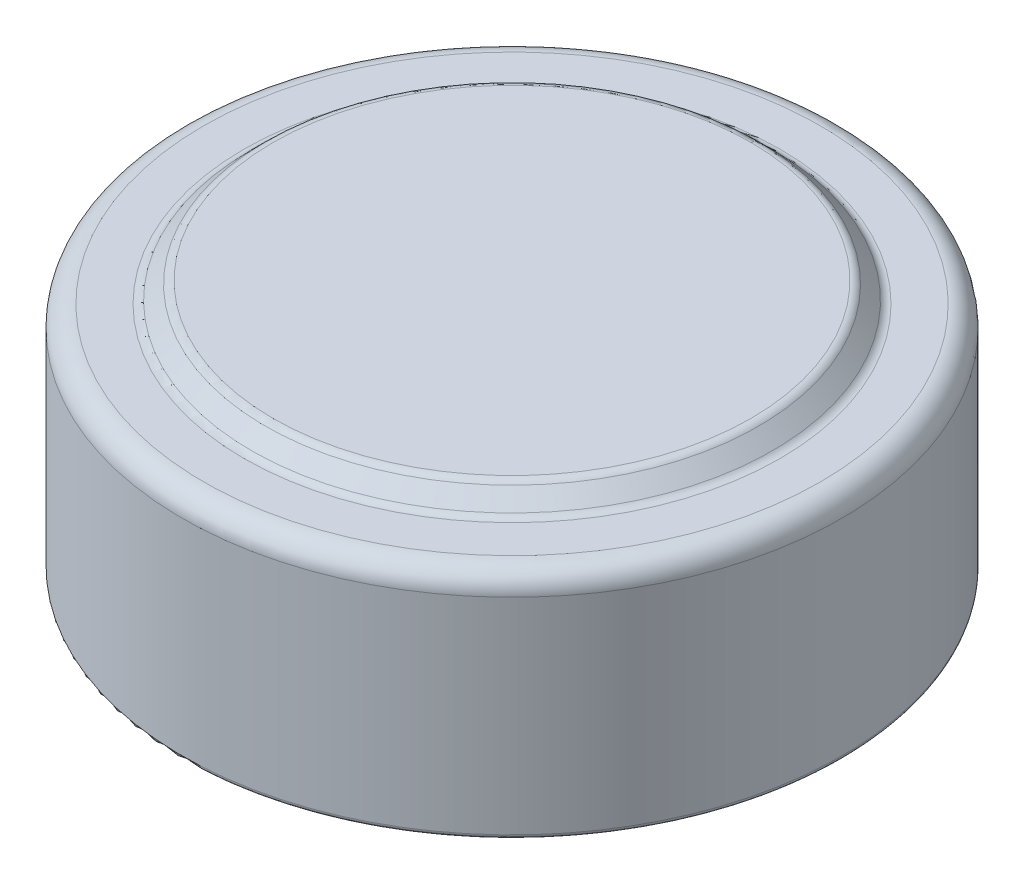
ISO-10303-21;
HEADER;
FILE_DESCRIPTION(('STEP AP214'),'2;1');
FILE_NAME('part.step','',(''),(''),'','','');
FILE_SCHEMA(('AUTOMOTIVE_DESIGN { 1 0 10303 214 1 1 1 1 }'));
ENDSEC;
DATA;
#1=APPLICATION_CONTEXT('core data for automotive mechanical design processes');
#2=APPLICATION_PROTOCOL_DEFINITION('international standard','automotive_design',2000,#1);
#3=PRODUCT_CONTEXT('',#1,'mechanical');
#4=PRODUCT('Part','Part','',(#3));
#5=PRODUCT_RELATED_PRODUCT_CATEGORY('part','',(#4));
#6=PRODUCT_DEFINITION_FORMATION('','',#4);
#7=PRODUCT_DEFINITION_CONTEXT('part definition',#1,'design');
#8=PRODUCT_DEFINITION('design','',#6,#7);
#9=PRODUCT_DEFINITION_SHAPE('','',#8);
#10=(LENGTH_UNIT() NAMED_UNIT(*) SI_UNIT(.MILLI.,.METRE.));
#11=(NAMED_UNIT(*) PLANE_ANGLE_UNIT() SI_UNIT($,.RADIAN.));
#12=(NAMED_UNIT(*) SI_UNIT($,.STERADIAN.) SOLID_ANGLE_UNIT());
#13=UNCERTAINTY_MEASURE_WITH_UNIT(LENGTH_MEASURE(1.E-05),#10,'distance_accuracy_value','');
#14=(GEOMETRIC_REPRESENTATION_CONTEXT(3) GLOBAL_UNCERTAINTY_ASSIGNED_CONTEXT((#13)) GLOBAL_UNIT_ASSIGNED_CONTEXT((#10,
#11,#12)) REPRESENTATION_CONTEXT('',''));
#15=CARTESIAN_POINT('',(0.,0.,0.));
#16=DIRECTION('',(0.,0.,1.));
#17=DIRECTION('',(1.,0.,0.));
#18=AXIS2_PLACEMENT_3D('',#15,#16,#17);
#19=CARTESIAN_POINT('',(0.,0.,0.));
#20=DIRECTION('',(0.,-1.,0.));
#21=DIRECTION('',(1.,0.,0.));
#22=AXIS2_PLACEMENT_3D('',#19,#20,#21);
#23=PLANE('',#22);
#24=DIRECTION('',(-1.,0.,0.));
#25=VECTOR('',#24,1.);
#26=CARTESIAN_POINT('',(-0.25,0.,2.));
#27=LINE('',#26,#25);
#28=CARTESIAN_POINT('',(0.25,0.,2.));
#29=VERTEX_POINT('',#28);
#30=CARTESIAN_POINT('',(-0.25,0.,2.));
#31=VERTEX_POINT('',#30);
#32=EDGE_CURVE('E1349',#29,#31,#27,.T.);
#33=ORIENTED_EDGE('',*,*,#32,.T.);
#34=DIRECTION('',(0.,0.,-1.));
#35=VECTOR('',#34,1.);
#36=CARTESIAN_POINT('',(-0.25,0.,2.));
#37=LINE('',#36,#35);
#38=CARTESIAN_POINT('',(-0.25,0.,0.25));
#39=VERTEX_POINT('',#38);
#40=EDGE_CURVE('E13',#31,#39,#37,.T.);
#41=ORIENTED_EDGE('',*,*,#40,.T.);
#42=DIRECTION('',(-1.,0.,0.));
#43=VECTOR('',#42,1.);
#44=CARTESIAN_POINT('',(-2.,0.,0.25));
#45=LINE('',#44,#43);
#46=CARTESIAN_POINT('',(-2.,0.,0.25));
#47=VERTEX_POINT('',#46);
#48=EDGE_CURVE('E1017',#39,#47,#45,.T.);
#49=ORIENTED_EDGE('',*,*,#48,.T.);
#50=DIRECTION('',(0.,0.,-1.));
#51=VECTOR('',#50,1.);
#52=CARTESIAN_POINT('',(-2.,0.,0.25));
#53=LINE('',#52,#51);
#54=CARTESIAN_POINT('',(-2.,0.,-0.25));
#55=VERTEX_POINT('',#54);
#56=EDGE_CURVE('E1376',#47,#55,#53,.T.);
#57=ORIENTED_EDGE('',*,*,#56,.T.);
#58=DIRECTION('',(1.,0.,0.));
#59=VECTOR('',#58,1.);
#60=CARTESIAN_POINT('',(-2.,0.,-0.25));
#61=LINE('',#60,#59);
#62=CARTESIAN_POINT('',(-0.25,0.,-0.25));
#63=VERTEX_POINT('',#62);
#64=EDGE_CURVE('E1373',#55,#63,#61,.T.);
#65=ORIENTED_EDGE('',*,*,#64,.T.);
#66=DIRECTION('',(0.,0.,-1.));
#67=VECTOR('',#66,1.);
#68=CARTESIAN_POINT('',(-0.25,0.,-0.25));
#69=LINE('',#68,#67);
#70=CARTESIAN_POINT('',(-0.25,0.,-2.));
#71=VERTEX_POINT('',#70);
#72=EDGE_CURVE('E1370',#63,#71,#69,.T.);
#73=ORIENTED_EDGE('',*,*,#72,.T.);
#74=DIRECTION('',(1.,0.,0.));
#75=VECTOR('',#74,1.);
#76=CARTESIAN_POINT('',(-0.25,0.,-2.));
#77=LINE('',#76,#75);
#78=CARTESIAN_POINT('',(0.25,0.,-2.));
#79=VERTEX_POINT('',#78);
#80=EDGE_CURVE('E1367',#71,#79,#77,.T.);
#81=ORIENTED_EDGE('',*,*,#80,.T.);
#82=DIRECTION('',(0.,0.,1.));
#83=VECTOR('',#82,1.);
#84=CARTESIAN_POINT('',(0.25,0.,-0.25));
#85=LINE('',#84,#83);
#86=CARTESIAN_POINT('',(0.25,0.,-0.25));
#87=VERTEX_POINT('',#86);
#88=EDGE_CURVE('E1364',#79,#87,#85,.T.);
#89=ORIENTED_EDGE('',*,*,#88,.T.);
#90=DIRECTION('',(1.,0.,0.));
#91=VECTOR('',#90,1.);
#92=CARTESIAN_POINT('',(0.25,0.,-0.25));
#93=LINE('',#92,#91);
#94=CARTESIAN_POINT('',(2.,0.,-0.25));
#95=VERTEX_POINT('',#94);
#96=EDGE_CURVE('E1361',#87,#95,#93,.T.);
#97=ORIENTED_EDGE('',*,*,#96,.T.);
#98=DIRECTION('',(0.,0.,1.));
#99=VECTOR('',#98,1.);
#100=CARTESIAN_POINT('',(2.,0.,0.25));
#101=LINE('',#100,#99);
#102=CARTESIAN_POINT('',(2.,0.,0.25));
#103=VERTEX_POINT('',#102);
#104=EDGE_CURVE('E1358',#95,#103,#101,.T.);
#105=ORIENTED_EDGE('',*,*,#104,.T.);
#106=DIRECTION('',(-1.,0.,0.));
#107=VECTOR('',#106,1.);
#108=CARTESIAN_POINT('',(0.25,0.,0.25));
#109=LINE('',#108,#107);
#110=CARTESIAN_POINT('',(0.25,0.,0.25));
#111=VERTEX_POINT('',#110);
#112=EDGE_CURVE('E1355',#103,#111,#109,.T.);
#113=ORIENTED_EDGE('',*,*,#112,.T.);
#114=DIRECTION('',(0.,0.,1.));
#115=VECTOR('',#114,1.);
#116=CARTESIAN_POINT('',(0.25,0.,2.));
#117=LINE('',#116,#115);
#118=EDGE_CURVE('E1352',#111,#29,#117,.T.);
#119=ORIENTED_EDGE('',*,*,#118,.T.);
#120=EDGE_LOOP('',(#33,#41,#49,#57,#65,#73,#81,#89,#97,#105,#113,#119));
#121=FACE_BOUND('',#120,.T.);
#122=ADVANCED_FACE('F1008',(#121),#23,.T.);
#123=ORIENTED_EDGE('',*,*,#40,.F.);
#124=ORIENTED_EDGE('',*,*,#32,.F.);
#125=ORIENTED_EDGE('',*,*,#118,.F.);
#126=ORIENTED_EDGE('',*,*,#112,.F.);
#127=ORIENTED_EDGE('',*,*,#104,.F.);
#128=ORIENTED_EDGE('',*,*,#96,.F.);
#129=ORIENTED_EDGE('',*,*,#88,.F.);
#130=ORIENTED_EDGE('',*,*,#80,.F.);
#131=ORIENTED_EDGE('',*,*,#72,.F.);
#132=ORIENTED_EDGE('',*,*,#64,.F.);
#133=ORIENTED_EDGE('',*,*,#56,.F.);
#134=ORIENTED_EDGE('',*,*,#48,.F.);
#135=EDGE_LOOP('',(#123,#124,#125,#126,#127,#128,#129,#130,#131,#132,#133,#134));
#136=FACE_BOUND('',#135,.T.);
#137=DIRECTION('',(-0.999997967618059,0.,-0.00201612493470823));
#138=VECTOR('',#137,1.);
#139=CARTESIAN_POINT('',(-0.24575017276862,0.,5.48015218725689));
#140=LINE('',#139,#138);
#141=CARTESIAN_POINT('',(-0.24575017276862,0.,5.48015218725689));
#142=VERTEX_POINT('',#141);
#143=CARTESIAN_POINT('',(-0.345109147127594,0.,5.47995186674407));
#144=VERTEX_POINT('',#143);
#145=EDGE_CURVE('E1252',#142,#144,#140,.T.);
#146=ORIENTED_EDGE('',*,*,#145,.T.);
#147=DIRECTION('',(-0.00181268584365623,0.,0.999998357083667));
#148=VECTOR('',#147,1.);
#149=CARTESIAN_POINT('',(-0.345109147127594,0.,5.47995186674407));
#150=LINE('',#149,#148);
#151=CARTESIAN_POINT('',(-0.346912031742979,0.,6.47454321289792));
#152=VERTEX_POINT('',#151);
#153=EDGE_CURVE('E1301',#144,#152,#150,.T.);
#154=ORIENTED_EDGE('',*,*,#153,.T.);
#155=DIRECTION('',(0.999997955269475,0.,0.002022240556661));
#156=VECTOR('',#155,1.);
#157=CARTESIAN_POINT('',(-0.346912031742979,0.,6.47454321289792));
#158=LINE('',#157,#156);
#159=CARTESIAN_POINT('',(-0.148795044563491,0.,6.47494385392356));
#160=VERTEX_POINT('',#159);
#161=EDGE_CURVE('E1295',#152,#160,#158,.T.);
#162=ORIENTED_EDGE('',*,*,#161,.T.);
#163=CARTESIAN_POINT('',(-0.148795044563491,0.,6.47494385392356));
#164=CARTESIAN_POINT('',(-0.135573615375887,0.,6.47490884577443));
#165=CARTESIAN_POINT('',(-0.110197659418802,0.,6.47484165445662));
#166=CARTESIAN_POINT('',(-0.0738032934458553,0.,6.47424174496659));
#167=CARTESIAN_POINT('',(-0.0406778357751591,0.,6.47327697200537));
#168=CARTESIAN_POINT('',(-0.0108947807294857,0.,6.47186780170862));
#169=CARTESIAN_POINT('',(0.0155790556774669,0.,6.47023352238498));
#170=CARTESIAN_POINT('',(0.0385933181856352,0.,6.46768137392707));
#171=CARTESIAN_POINT('',(0.0583744991553882,0.,6.46536378822217));
#172=CARTESIAN_POINT('',(0.0703014037181199,0.,6.46286651782277));
#173=CARTESIAN_POINT('',(0.0757642503083034,0.,6.4617227000774));
#174=B_SPLINE_CURVE_WITH_KNOTS('',3,(#163,#164,#165,#166,#167,#168,#169,#170,#171,#172,#173),
.UNSPECIFIED.,.F.,.F.,(4,1,1,1,1,1,1,1,4),(0.,0.176064366226752,0.337921229209516,
0.484707011570861,0.617344334054567,0.73499158843748,0.837805101821769,0.92571032644742,1.),.UNSPECIFIED.);
#175=CARTESIAN_POINT('',(0.0757642503083034,0.,6.4617227000774));
#176=VERTEX_POINT('',#175);
#177=EDGE_CURVE('E1287',#160,#176,#174,.T.);
#178=ORIENTED_EDGE('',*,*,#177,.T.);
#179=CARTESIAN_POINT('',(0.0757642503083034,0.,6.4617227000774));
#180=CARTESIAN_POINT('',(0.0830080483921917,0.,6.45989783311528));
#181=CARTESIAN_POINT('',(0.0973197268117107,0.,6.45629241661721));
#182=CARTESIAN_POINT('',(0.118003053982155,0.,6.44900128398854));
#183=CARTESIAN_POINT('',(0.137691030550522,0.,6.4403715934872));
#184=CARTESIAN_POINT('',(0.156422090818116,0.,6.43042051802343));
#185=CARTESIAN_POINT('',(0.173886966404073,0.,6.41866791868947));
#186=CARTESIAN_POINT('',(0.19036867983076,0.,6.40561350071653));
#187=CARTESIAN_POINT('',(0.205910914579534,0.,6.39113201257329));
#188=CARTESIAN_POINT('',(0.220152758802699,0.,6.37517293789059));
#189=CARTESIAN_POINT('',(0.233353258995435,0.,6.35820196970024));
#190=CARTESIAN_POINT('',(0.244448510218859,0.,6.33987520974977));
#191=CARTESIAN_POINT('',(0.254155301622547,0.,6.32084163012419));
#192=CARTESIAN_POINT('',(0.26207532802548,0.,6.3008051988161));
#193=CARTESIAN_POINT('',(0.267983890857681,0.,6.27970079109947));
#194=CARTESIAN_POINT('',(0.272426994834388,0.,6.25768056785205));
#195=CARTESIAN_POINT('',(0.275036823775737,0.,6.23468777408315));
#196=CARTESIAN_POINT('',(0.275465686854256,0.,6.2190742584543));
#197=CARTESIAN_POINT('',(0.275684122103175,0.,6.21112173853894));
#198=B_SPLINE_CURVE_WITH_KNOTS('',3,(#179,#180,#181,#182,#183,#184,#185,#186,#187,#188,#189,
#190,#191,#192,#193,#194,#195,#196,#197),.UNSPECIFIED.,.F.,.F.,(4,1,1,1,1,1,1,1,1,1,1,1,1,1,1,1,
4),(0.,0.0643523488828735,0.127141882212433,0.188727908886166,0.249491091520758,
0.309662784300045,0.369878490392546,0.430543491877956,0.492480729177977,0.554058689398358,
0.61554784879087,0.676799576580252,0.738032378235542,0.800874631585583,0.865429932550656,
0.931458669088941,1.),.UNSPECIFIED.);
#199=CARTESIAN_POINT('',(0.275684122103175,0.,6.21112173853894));
#200=VERTEX_POINT('',#199);
#201=EDGE_CURVE('E1279',#176,#200,#198,.T.);
#202=ORIENTED_EDGE('',*,*,#201,.T.);
#203=CARTESIAN_POINT('',(0.275684122103175,0.,6.21112173853894));
#204=CARTESIAN_POINT('',(0.275222894472053,0.,6.19800412707376));
#205=CARTESIAN_POINT('',(0.274321737643172,0.,6.17237464533238));
#206=CARTESIAN_POINT('',(0.2672492599839,0.,6.13508305551279));
#207=CARTESIAN_POINT('',(0.255075022756078,0.,6.10033178458293));
#208=CARTESIAN_POINT('',(0.238480463193786,0.,6.06812832839628));
#209=CARTESIAN_POINT('',(0.217301192842413,0.,6.0390402962661));
#210=CARTESIAN_POINT('',(0.191806234558142,0.,6.01358021747295));
#211=CARTESIAN_POINT('',(0.162148142323468,0.,5.99191729657077));
#212=CARTESIAN_POINT('',(0.134248514928151,0.,5.97731261963704));
#213=CARTESIAN_POINT('',(0.109736289266416,0.,5.96756363612358));
#214=CARTESIAN_POINT('',(0.0894420691499433,0.,5.96117180276661));
#215=CARTESIAN_POINT('',(0.0674699067692535,0.,5.95584422892102));
#216=CARTESIAN_POINT('',(0.0438400090574644,0.,5.95112991776116));
#217=CARTESIAN_POINT('',(0.0183879704000981,0.,5.94791198763913));
#218=CARTESIAN_POINT('',(-0.00866689077815023,0.,5.94532558628991));
#219=CARTESIAN_POINT('',(-0.0373897687380123,0.,5.94338771855144));
#220=CARTESIAN_POINT('',(-0.0571116107730482,0.,5.94319308930524));
#221=CARTESIAN_POINT('',(-0.0672645958455428,0.,5.9430928923851));
#222=B_SPLINE_CURVE_WITH_KNOTS('',3,(#203,#204,#205,#206,#207,#208,#209,#210,#211,#212,#213,
#214,#215,#216,#217,#218,#219,#220,#221),.UNSPECIFIED.,.F.,.F.,(4,1,1,1,1,1,1,1,1,1,1,1,1,1,1,1,
4),(0.,0.0795044829155837,0.155337631294389,0.229091952793264,0.302069838470641,
0.37422546277292,0.446370863111379,0.519658073481947,0.596085510995983,0.636609633392865,
0.67950558232071,0.724970943763673,0.77364551180172,0.825523512467502,0.880434745486717,
0.938446710905309,1.),.UNSPECIFIED.);
#223=CARTESIAN_POINT('',(-0.0672645958455432,0.,5.9430928923851));
#224=VERTEX_POINT('',#223);
#225=EDGE_CURVE('E1274',#200,#224,#222,.T.);
#226=ORIENTED_EDGE('',*,*,#225,.T.);
#227=DIRECTION('',(0.612967601433019,0.,-0.790108042987446));
#228=VECTOR('',#227,1.);
#229=CARTESIAN_POINT('',(-0.0672645958455428,0.,5.9430928923851));
#230=LINE('',#229,#228);
#231=CARTESIAN_POINT('',(0.291108801590355,0.,5.48115378982099));
#232=VERTEX_POINT('',#231);
#233=EDGE_CURVE('E1271',#224,#232,#230,.T.);
#234=ORIENTED_EDGE('',*,*,#233,.T.);
#235=DIRECTION('',(-0.99999867372862,0.,-0.00162866233505838));
#236=VECTOR('',#235,1.);
#237=CARTESIAN_POINT('',(0.291108801590355,0.,5.48115378982099));
#238=LINE('',#237,#236);
#239=CARTESIAN_POINT('',(0.16811200671856,0.,5.48095346930817));
#240=VERTEX_POINT('',#239);
#241=EDGE_CURVE('E1268',#232,#240,#238,.T.);
#242=ORIENTED_EDGE('',*,*,#241,.T.);
#243=DIRECTION('',(-0.612491317030842,0.,0.790477315652906));
#244=VECTOR('',#243,1.);
#245=CARTESIAN_POINT('',(0.16811200671856,0.,5.48095346930817));
#246=LINE('',#245,#244);
#247=CARTESIAN_POINT('',(-0.189660429178876,0.,5.94269225135946));
#248=VERTEX_POINT('',#247);
#249=EDGE_CURVE('E1265',#240,#248,#246,.T.);
#250=ORIENTED_EDGE('',*,*,#249,.T.);
#251=DIRECTION('',(-1.,0.,0.));
#252=VECTOR('',#251,1.);
#253=CARTESIAN_POINT('',(-0.189660429178876,0.,5.94269225135946));
#254=LINE('',#253,#252);
#255=CARTESIAN_POINT('',(-0.246551454819902,0.,5.94269225135946));
#256=VERTEX_POINT('',#255);
#257=EDGE_CURVE('E1262',#248,#256,#254,.T.);
#258=ORIENTED_EDGE('',*,*,#257,.T.);
#259=DIRECTION('',(0.0017323490679639,0.,-0.999998499482228));
#260=VECTOR('',#259,1.);
#261=CARTESIAN_POINT('',(-0.246551454819902,0.,5.94269225135946));
#262=LINE('',#261,#260);
#263=EDGE_CURVE('E1259',#256,#142,#262,.T.);
#264=ORIENTED_EDGE('',*,*,#263,.T.);
#265=EDGE_LOOP('',(#146,#154,#162,#178,#202,#226,#234,#242,#250,#258,#264));
#266=FACE_BOUND('',#265,.T.);
#267=CARTESIAN_POINT('',(0.,0.,0.));
#268=DIRECTION('',(0.,1.,0.));
#269=DIRECTION('',(-1.,0.,0.));
#270=AXIS2_PLACEMENT_3D('',#267,#268,#269);
#271=CIRCLE('',#270,7.7);
#272=CARTESIAN_POINT('',(-7.7,0.,0.));
#273=VERTEX_POINT('',#272);
#274=EDGE_CURVE('E1172',#273,#273,#271,.T.);
#275=ORIENTED_EDGE('',*,*,#274,.F.);
#276=EDGE_LOOP('',(#275));
#277=FACE_BOUND('',#276,.T.);
#278=CARTESIAN_POINT('',(1.14440576339474,0.,6.10257797058904));
#279=CARTESIAN_POINT('',(1.14267778538298,0.,6.0923150395133));
#280=CARTESIAN_POINT('',(1.13915884606007,0.,6.07141510242788));
#281=CARTESIAN_POINT('',(1.12982491620683,0.,6.04038488079859));
#282=CARTESIAN_POINT('',(1.11787759470241,0.,6.00893149353778));
#283=CARTESIAN_POINT('',(1.10493701739911,0.,5.98296985677421));
#284=CARTESIAN_POINT('',(1.09301371672932,0.,5.9616758514408));
#285=CARTESIAN_POINT('',(1.08254375562409,0.,5.94486223929022));
#286=CARTESIAN_POINT('',(1.07080292715997,0.,5.92734512816029));
#287=CARTESIAN_POINT('',(1.05766314999315,0.,5.90920521122916));
#288=CARTESIAN_POINT('',(1.04320383365771,0.,5.89044697297638));
#289=CARTESIAN_POINT('',(1.02763621728649,0.,5.87077553434667));
#290=CARTESIAN_POINT('',(1.01059151988626,0.,5.85054321434036));
#291=CARTESIAN_POINT('',(0.998540350521887,0.,5.83705606415367));
#292=CARTESIAN_POINT('',(0.992362494163972,0.,5.83014207315314));
#293=B_SPLINE_CURVE_WITH_KNOTS('',3,(#278,#279,#280,#281,#282,#283,#284,#285,#286,#287,#288,
#289,#290,#291,#292),.UNSPECIFIED.,.F.,.F.,(4,1,1,1,1,1,1,1,1,1,1,1,4),(0.,0.0984850773633282,
0.200559850354269,0.306265127676059,0.416855952475023,0.474905590193942,0.537385366755915,
0.604390447329588,0.674601910387479,0.749485829544024,0.828699173871165,0.912185127781514,1.),.UNSPECIFIED.);
#294=CARTESIAN_POINT('',(1.14440576339474,0.,6.10257797058904));
#295=VERTEX_POINT('',#294);
#296=CARTESIAN_POINT('',(0.992362494163972,0.,5.83014207315314));
#297=VERTEX_POINT('',#296);
#298=EDGE_CURVE('E1163',#295,#297,#293,.T.);
#299=ORIENTED_EDGE('',*,*,#298,.T.);
#300=DIRECTION('',(-0.665625985954595,0.,-0.746285499538865));
#301=VECTOR('',#300,1.);
#302=CARTESIAN_POINT('',(0.992362494163972,0.,5.83014207315314));
#303=LINE('',#302,#301);
#304=CARTESIAN_POINT('',(0.63198589159987,0.,5.42609559879417));
#305=VERTEX_POINT('',#304);
#306=EDGE_CURVE('E1170',#297,#305,#303,.T.);
#307=ORIENTED_EDGE('',*,*,#306,.T.);
#308=DIRECTION('',(-0.757655677533589,0.,0.652654483092792));
#309=VECTOR('',#308,1.);
#310=CARTESIAN_POINT('',(0.63198589159987,0.,5.42609559879417));
#311=LINE('',#310,#309);
#312=CARTESIAN_POINT('',(0.558267942881921,0.,5.48959720135827));
#313=VERTEX_POINT('',#312);
#314=EDGE_CURVE('E1217',#305,#313,#311,.T.);
#315=ORIENTED_EDGE('',*,*,#314,.T.);
#316=DIRECTION('',(0.659812489585063,0.,0.75143028857477));
#317=VECTOR('',#316,1.);
#318=CARTESIAN_POINT('',(0.558267942881921,0.,5.48959720135827));
#319=LINE('',#318,#317);
#320=CARTESIAN_POINT('',(0.879982686471665,0.,5.85598341930699));
#321=VERTEX_POINT('',#320);
#322=EDGE_CURVE('E1211',#313,#321,#319,.T.);
#323=ORIENTED_EDGE('',*,*,#322,.T.);
#324=CARTESIAN_POINT('',(0.879982686471665,0.,5.85598341930699));
#325=CARTESIAN_POINT('',(0.87085302576854,0.,5.85448633834904));
#326=CARTESIAN_POINT('',(0.853064744087003,0.,5.85156941748572));
#327=CARTESIAN_POINT('',(0.826661988511281,0.,5.84999031332602));
#328=CARTESIAN_POINT('',(0.801394499816977,0.,5.849638626471));
#329=CARTESIAN_POINT('',(0.785021760742135,0.,5.85147831691324));
#330=CARTESIAN_POINT('',(0.777017942881921,0.,5.85237765007622));
#331=B_SPLINE_CURVE_WITH_KNOTS('',3,(#324,#325,#326,#327,#328,#329,#330),.UNSPECIFIED.,.F.,.F.,
(4,1,1,1,4),(0.,0.268180892066763,0.522525141384143,0.766586288114427,1.),.UNSPECIFIED.);
#332=CARTESIAN_POINT('',(0.777017942881921,0.,5.85237765007622));
#333=VERTEX_POINT('',#332);
#334=EDGE_CURVE('E1203',#321,#333,#331,.T.);
#335=ORIENTED_EDGE('',*,*,#334,.T.);
#336=CARTESIAN_POINT('',(0.777017942881921,0.,5.85237765007622));
#337=CARTESIAN_POINT('',(0.767426123873589,0.,5.85390903408389));
#338=CARTESIAN_POINT('',(0.748560836755377,0.,5.85692097571539));
#339=CARTESIAN_POINT('',(0.721321672266046,0.,5.86491272273913));
#340=CARTESIAN_POINT('',(0.695612433643268,0.,5.87531080995275));
#341=CARTESIAN_POINT('',(0.671405570163664,0.,5.8882533614665));
#342=CARTESIAN_POINT('',(0.648592773788989,0.,5.90354798167863));
#343=CARTESIAN_POINT('',(0.627340647198401,0.,5.92144823799871));
#344=CARTESIAN_POINT('',(0.607572859626174,0.,5.94187377795498));
#345=CARTESIAN_POINT('',(0.589559940034781,0.,5.9644987566015));
#346=CARTESIAN_POINT('',(0.573562921755995,0.,5.98882515997987));
#347=CARTESIAN_POINT('',(0.560150358543541,0.,6.01434248615343));
#348=CARTESIAN_POINT('',(0.549144264585504,0.,6.04061754257484));
#349=CARTESIAN_POINT('',(0.541411298963939,0.,6.06788558241053));
#350=CARTESIAN_POINT('',(0.536147369101856,0.,6.09591372886544));
#351=CARTESIAN_POINT('',(0.533564243197429,0.,6.12481830573977));
#352=CARTESIAN_POINT('',(0.533684940710717,0.,6.15468442474335));
#353=CARTESIAN_POINT('',(0.536036288445922,0.,6.17470785699227));
#354=CARTESIAN_POINT('',(0.537234289035767,0.,6.18490970135827));
#355=B_SPLINE_CURVE_WITH_KNOTS('',3,(#336,#337,#338,#339,#340,#341,#342,#343,#344,#345,#346,
#347,#348,#349,#350,#351,#352,#353,#354),.UNSPECIFIED.,.F.,.F.,(4,1,1,1,1,1,1,1,1,1,1,1,1,1,1,1,
4),(0.,0.0637297524016026,0.125344324781819,0.185923601743264,0.245556069324966,
0.305267474466693,0.365956144749733,0.427662699008025,0.49162131672979,0.555590454579078,
0.618550805507115,0.680679650778481,0.742294223158696,0.804299163744197,0.86769620040507,
0.932591837617067,1.),.UNSPECIFIED.);
#356=CARTESIAN_POINT('',(0.537234289035767,0.,6.18490970135827));
#357=VERTEX_POINT('',#356);
#358=EDGE_CURVE('E1195',#333,#357,#355,.T.);
#359=ORIENTED_EDGE('',*,*,#358,.T.);
#360=CARTESIAN_POINT('',(0.537234289035767,0.,6.18490970135827));
#361=CARTESIAN_POINT('',(0.539605985350254,0.,6.19868565500223));
#362=CARTESIAN_POINT('',(0.54426290429142,0.,6.22573528149333));
#363=CARTESIAN_POINT('',(0.557444261738531,0.,6.26434166519705));
#364=CARTESIAN_POINT('',(0.574787398132381,0.,6.30034367794117));
#365=CARTESIAN_POINT('',(0.59728318984876,0.,6.33309438979366));
#366=CARTESIAN_POINT('',(0.623692370439431,0.,6.36258569803455));
#367=CARTESIAN_POINT('',(0.653969661089755,0.,6.38829576732969));
#368=CARTESIAN_POINT('',(0.688081591625794,0.,6.4096073676536));
#369=CARTESIAN_POINT('',(0.725137582025532,0.,6.42690254092829));
#370=CARTESIAN_POINT('',(0.764390352286336,0.,6.43979694895622));
#371=CARTESIAN_POINT('',(0.804818506811526,0.,6.44710266626717));
#372=CARTESIAN_POINT('',(0.845849355162907,0.,6.44962848351987));
#373=CARTESIAN_POINT('',(0.873051337712212,0.,6.44690338748204));
#374=CARTESIAN_POINT('',(0.886793583907562,0.,6.44552668853776));
#375=B_SPLINE_CURVE_WITH_KNOTS('',3,(#360,#361,#362,#363,#364,#365,#366,#367,#368,#369,#370,
#371,#372,#373,#374),.UNSPECIFIED.,.F.,.F.,(4,1,1,1,1,1,1,1,1,1,1,1,4),(0.,0.0862358226622743,
0.169327427592709,0.251052178809953,0.332398169302719,0.413893578707685,0.494966143568758,
0.576906098454638,0.661608014060104,0.747049960462201,0.831354200478888,0.914801353444365,1.),.UNSPECIFIED.);
#376=CARTESIAN_POINT('',(0.886793583907562,0.,6.44552668853776));
#377=VERTEX_POINT('',#376);
#378=EDGE_CURVE('E1165',#357,#377,#375,.T.);
#379=ORIENTED_EDGE('',*,*,#378,.T.);
#380=CARTESIAN_POINT('',(0.886793583907562,0.,6.44552668853776));
#381=CARTESIAN_POINT('',(0.900099757360611,0.,6.44321159566596));
#382=CARTESIAN_POINT('',(0.92648781391807,0.,6.43862043338687));
#383=CARTESIAN_POINT('',(0.964256967437521,0.,6.42554268958782));
#384=CARTESIAN_POINT('',(0.999813043567319,0.,6.40791391873341));
#385=CARTESIAN_POINT('',(1.03270173506534,0.,6.38569954178712));
#386=CARTESIAN_POINT('',(1.06258575532036,0.,6.35961965294882));
#387=CARTESIAN_POINT('',(1.08834837101949,0.,6.32959343527734));
#388=CARTESIAN_POINT('',(1.10964161146851,0.,6.29607213895356));
#389=CARTESIAN_POINT('',(1.1265508957345,0.,6.25967210438812));
#390=CARTESIAN_POINT('',(1.13900176896746,0.,6.22140804515166));
#391=CARTESIAN_POINT('',(1.14622509692325,0.,6.18208352416078));
#392=CARTESIAN_POINT('',(1.14845106835139,0.,6.14224483506366));
#393=CARTESIAN_POINT('',(1.14575942333781,0.,6.11585149287773));
#394=CARTESIAN_POINT('',(1.14440576339474,0.,6.10257797058904));
#395=B_SPLINE_CURVE_WITH_KNOTS('',3,(#380,#381,#382,#383,#384,#385,#386,#387,#388,#389,#390,
#391,#392,#393,#394),.UNSPECIFIED.,.F.,.F.,(4,1,1,1,1,1,1,1,1,1,1,1,4),(0.,0.0847666779385687,
0.168104519268708,0.250115379179538,0.333565135870313,0.416820528306918,0.49865835459516,
0.581308739287171,0.665601481323128,0.750268384814635,0.833480405973959,0.916255337151394,1.),.UNSPECIFIED.);
#396=EDGE_CURVE('E1159',#377,#295,#395,.T.);
#397=ORIENTED_EDGE('',*,*,#396,.T.);
#398=EDGE_LOOP('',(#299,#307,#315,#323,#335,#359,#379,#397));
#399=FACE_BOUND('',#398,.T.);
#400=DIRECTION('',(-0.989982687243314,0.,-0.14118880606658));
#401=VECTOR('',#400,1.);
#402=CARTESIAN_POINT('',(-0.510748524968753,0.,5.47231181198752));
#403=LINE('',#402,#401);
#404=CARTESIAN_POINT('',(-0.510748524968753,0.,5.47231181198752));
#405=VERTEX_POINT('',#404);
#406=CARTESIAN_POINT('',(-0.988312627532856,0.,5.40420283762854));
#407=VERTEX_POINT('',#406);
#408=EDGE_CURVE('E1330',#405,#407,#403,.T.);
#409=ORIENTED_EDGE('',*,*,#408,.T.);
#410=DIRECTION('',(-0.140885968875055,0.,0.990025829851998));
#411=VECTOR('',#410,1.);
#412=CARTESIAN_POINT('',(-0.988312627532856,0.,5.40420283762854));
#413=LINE('',#412,#411);
#414=CARTESIAN_POINT('',(-1.12853698650721,0.,6.38957944019265));
#415=VERTEX_POINT('',#414);
#416=EDGE_CURVE('E1346',#407,#415,#413,.T.);
#417=ORIENTED_EDGE('',*,*,#416,.T.);
#418=DIRECTION('',(0.989828913823365,0.,0.142262860083921));
#419=VECTOR('',#418,1.);
#420=CARTESIAN_POINT('',(-1.12853698650721,0.,6.38957944019265));
#421=LINE('',#420,#419);
#422=CARTESIAN_POINT('',(-1.02957865317388,0.,6.4038021966029));
#423=VERTEX_POINT('',#422);
#424=EDGE_CURVE('E1343',#415,#423,#421,.T.);
#425=ORIENTED_EDGE('',*,*,#424,.T.);
#426=DIRECTION('',(0.14079754158494,0.,-0.990038409499165));
#427=VECTOR('',#426,1.);
#428=CARTESIAN_POINT('',(-1.02957865317388,0.,6.4038021966029));
#429=LINE('',#428,#427);
#430=CARTESIAN_POINT('',(-0.902976089071317,0.,5.51357783762854));
#431=VERTEX_POINT('',#430);
#432=EDGE_CURVE('E1340',#423,#431,#429,.T.);
#433=ORIENTED_EDGE('',*,*,#432,.T.);
#434=DIRECTION('',(0.990022695576332,0.,0.140907992121712));
#435=VECTOR('',#434,1.);
#436=CARTESIAN_POINT('',(-0.902976089071317,0.,5.51357783762854));
#437=LINE('',#436,#435);
#438=CARTESIAN_POINT('',(-0.524370319840548,0.,5.56746405557726));
#439=VERTEX_POINT('',#438);
#440=EDGE_CURVE('E1337',#431,#439,#437,.T.);
#441=ORIENTED_EDGE('',*,*,#440,.T.);
#442=DIRECTION('',(0.141713112385409,0.,-0.989907770339258));
#443=VECTOR('',#442,1.);
#444=CARTESIAN_POINT('',(-0.524370319840548,0.,5.56746405557726));
#445=LINE('',#444,#443);
#446=EDGE_CURVE('E1334',#439,#405,#445,.T.);
#447=ORIENTED_EDGE('',*,*,#446,.T.);
#448=EDGE_LOOP('',(#409,#417,#425,#433,#441,#447));
#449=FACE_BOUND('',#448,.T.);
#450=ADVANCED_FACE('F1161',(#136,#266,#277,#399,#449),#23,.T.);
#451=CARTESIAN_POINT('',(0.172318737487791,0.,6.21112173853894));
#452=CARTESIAN_POINT('',(0.17194976576467,0.,6.21929266842133));
#453=CARTESIAN_POINT('',(0.171222885986189,0.,6.23538952173206));
#454=CARTESIAN_POINT('',(0.166101785407569,0.,6.25901007452062));
#455=CARTESIAN_POINT('',(0.157405704568043,0.,6.28131869106785));
#456=CARTESIAN_POINT('',(0.145515604539429,0.,6.3021787350424));
#457=CARTESIAN_POINT('',(0.131087853096918,0.,6.321050721286));
#458=CARTESIAN_POINT('',(0.114289913118808,0.,6.33738471074467));
#459=CARTESIAN_POINT('',(0.0951453484437949,0.,6.35053516335762));
#460=CARTESIAN_POINT('',(0.0773717011553149,0.,6.35912491871262));
#461=CARTESIAN_POINT('',(0.061592297713181,0.,6.36472027572995));
#462=CARTESIAN_POINT('',(0.0477315617319472,0.,6.36801915527501));
#463=CARTESIAN_POINT('',(0.0322149201912013,0.,6.37094455208527));
#464=CARTESIAN_POINT('',(0.0148683721802088,0.,6.37368261339534));
#465=CARTESIAN_POINT('',(-0.00434842506326858,0.,6.37526992077812));
#466=CARTESIAN_POINT('',(-0.0253777671227763,0.,6.37675133400779));
#467=CARTESIAN_POINT('',(-0.0482284863575259,0.,6.37752105287018));
#468=CARTESIAN_POINT('',(-0.0640590481273328,0.,6.37756518637585));
#469=CARTESIAN_POINT('',(-0.0722726086660556,0.,6.37758808469279));
#470=B_SPLINE_CURVE_WITH_KNOTS('',3,(#451,#452,#453,#454,#455,#456,#457,#458,#459,#460,#461,
#462,#463,#464,#465,#466,#467,#468,#469),.UNSPECIFIED.,.F.,.F.,(4,1,1,1,1,1,1,1,1,1,1,1,1,1,1,1,
4),(0.,0.0726218476682741,0.143066119266491,0.213732664303543,0.284715180822145,
0.355839054924782,0.424273552681393,0.492118443564815,0.561415234907535,0.599152755134559,
0.64076319585236,0.687916181559962,0.739549899709846,0.796789995130491,0.859261388581377,
0.926978895516685,1.),.UNSPECIFIED.);
#471=CARTESIAN_POINT('',(0.172318737487791,0.,6.21112173853894));
#472=VERTEX_POINT('',#471);
#473=CARTESIAN_POINT('',(-0.0722726086660556,0.,6.37758808469279));
#474=VERTEX_POINT('',#473);
#475=EDGE_CURVE('E1304',#472,#474,#470,.T.);
#476=ORIENTED_EDGE('',*,*,#475,.T.);
#477=DIRECTION('',(-0.999999345444144,0.,-0.00114416401080248));
#478=VECTOR('',#477,1.);
#479=CARTESIAN_POINT('',(-0.0722726086660556,0.,6.37758808469279));
#480=LINE('',#479,#478);
#481=CARTESIAN_POINT('',(-0.247352736871184,0.,6.37738776417997));
#482=VERTEX_POINT('',#481);
#483=EDGE_CURVE('E1327',#474,#482,#480,.T.);
#484=ORIENTED_EDGE('',*,*,#483,.T.);
#485=DIRECTION('',(0.00177724837800883,0.,-0.999998420692854));
#486=VECTOR('',#485,1.);
#487=CARTESIAN_POINT('',(-0.247352736871184,0.,6.37738776417997));
#488=LINE('',#487,#486);
#489=CARTESIAN_POINT('',(-0.246751775332722,0.,6.03924673853894));
#490=VERTEX_POINT('',#489);
#491=EDGE_CURVE('E1324',#482,#490,#488,.T.);
#492=ORIENTED_EDGE('',*,*,#491,.T.);
#493=DIRECTION('',(0.999975320253978,0.,-0.00702558773012241));
#494=VECTOR('',#493,1.);
#495=CARTESIAN_POINT('',(-0.246751775332722,0.,6.03924673853894));
#496=LINE('',#495,#494);
#497=CARTESIAN_POINT('',(-0.0756780573840043,0.,6.03804481546202));
#498=VERTEX_POINT('',#497);
#499=EDGE_CURVE('E1318',#490,#498,#496,.T.);
#500=ORIENTED_EDGE('',*,*,#499,.T.);
#501=CARTESIAN_POINT('',(-0.0756780573840043,0.,6.03804481546202));
#502=CARTESIAN_POINT('',(-0.0676651032681025,0.,6.03815624208333));
#503=CARTESIAN_POINT('',(-0.0521696630437907,0.,6.03837171873837));
#504=CARTESIAN_POINT('',(-0.0297122865115374,0.,6.03904373132285));
#505=CARTESIAN_POINT('',(-0.00886881755169642,0.,6.04068007060876));
#506=CARTESIAN_POINT('',(0.0103005773701836,0.,6.04287913902567));
#507=CARTESIAN_POINT('',(0.0278836374401322,0.,6.04547228615798));
#508=CARTESIAN_POINT('',(0.0438661927524948,0.,6.04849597190664));
#509=CARTESIAN_POINT('',(0.0581723257571776,0.,6.05266749169065));
#510=CARTESIAN_POINT('',(0.075068233615036,0.,6.05825018887277));
#511=CARTESIAN_POINT('',(0.0938113938469979,0.,6.06775619188669));
#512=CARTESIAN_POINT('',(0.114223988994133,0.,6.08125770016398));
#513=CARTESIAN_POINT('',(0.131606168943681,0.,6.09823503574357));
#514=CARTESIAN_POINT('',(0.146193324501373,0.,6.11766341051657));
#515=CARTESIAN_POINT('',(0.157823757100019,0.,6.13915691491293));
#516=CARTESIAN_POINT('',(0.166250205661397,0.,6.16208290641554));
#517=CARTESIAN_POINT('',(0.171485307908315,0.,6.1862470230173));
#518=CARTESIAN_POINT('',(0.172038196601856,0.,6.20274865591546));
#519=CARTESIAN_POINT('',(0.172318737487791,0.,6.21112173853894));
#520=B_SPLINE_CURVE_WITH_KNOTS('',3,(#501,#502,#503,#504,#505,#506,#507,#508,#509,#510,#511,
#512,#513,#514,#515,#516,#517,#518,#519),.UNSPECIFIED.,.F.,.F.,(4,1,1,1,1,1,1,1,1,1,1,1,1,1,1,1,
4),(0.,0.0697491129611875,0.134880743725215,0.195500136280044,0.251656737094402,
0.302779167826135,0.350192861454138,0.393061184561164,0.432391721141823,0.504906661111504,
0.575186413330099,0.644646809312296,0.715199959313026,0.785932399969961,0.856538189083381,
0.927206137505795,1.),.UNSPECIFIED.);
#521=EDGE_CURVE('E1310',#498,#472,#520,.T.);
#522=ORIENTED_EDGE('',*,*,#521,.T.);
#523=EDGE_LOOP('',(#476,#484,#492,#500,#522));
#524=FACE_BOUND('',#523,.T.);
#525=ADVANCED_FACE('F1481',(#524),#23,.T.);
#526=ORIENTED_EDGE('',*,*,#416,.F.);
#527=ORIENTED_EDGE('',*,*,#408,.F.);
#528=ORIENTED_EDGE('',*,*,#446,.F.);
#529=ORIENTED_EDGE('',*,*,#440,.F.);
#530=ORIENTED_EDGE('',*,*,#432,.F.);
#531=ORIENTED_EDGE('',*,*,#424,.F.);
#532=EDGE_LOOP('',(#526,#527,#528,#529,#530,#531));
#533=FACE_BOUND('',#532,.T.);
#534=ADVANCED_FACE('F1544',(#533),#23,.T.);
#535=CARTESIAN_POINT('',(0.869365699292178,0.,6.34957316289673));
#536=CARTESIAN_POINT('',(0.862297341868679,0.,6.35038188512749));
#537=CARTESIAN_POINT('',(0.848391036217111,0.,6.35197296744753));
#538=CARTESIAN_POINT('',(0.827647291301995,0.,6.35190480340999));
#539=CARTESIAN_POINT('',(0.807444741680791,0.,6.34992910660473));
#540=CARTESIAN_POINT('',(0.787724901359477,0.,6.34586004790983));
#541=CARTESIAN_POINT('',(0.768436209455533,0.,6.33997028018753));
#542=CARTESIAN_POINT('',(0.74992251831118,0.,6.33150470185659));
#543=CARTESIAN_POINT('',(0.731773789414199,0.,6.32148625152674));
#544=CARTESIAN_POINT('',(0.714312864874196,0.,6.30957563782671));
#545=CARTESIAN_POINT('',(0.698121014433094,0.,6.29612540069425));
#546=CARTESIAN_POINT('',(0.683387665285434,0.,6.28152980156263));
#547=CARTESIAN_POINT('',(0.670699027025937,0.,6.26572259148379));
#548=CARTESIAN_POINT('',(0.659470024243753,0.,6.2489773889366));
#549=CARTESIAN_POINT('',(0.65033879023017,0.,6.23111383552829));
#550=CARTESIAN_POINT('',(0.642775213365398,0.,6.21223836718484));
#551=CARTESIAN_POINT('',(0.637187012187288,0.,6.19227619861065));
#552=CARTESIAN_POINT('',(0.634928258945764,0.,6.17845876549291));
#553=CARTESIAN_POINT('',(0.633788776215255,0.,6.1714882269993));
#554=B_SPLINE_CURVE_WITH_KNOTS('',3,(#535,#536,#537,#538,#539,#540,#541,#542,#543,#544,#545,
#546,#547,#548,#549,#550,#551,#552,#553),.UNSPECIFIED.,.F.,.F.,(4,1,1,1,1,1,1,1,1,1,1,1,1,1,1,1,
4),(0.,0.0649137171350644,0.127711423938262,0.188984156235714,0.249964996127806,
0.311286242076799,0.372695321332486,0.435466385696356,0.500403004125884,0.565351070174438,
0.627431405539338,0.689418862282874,0.750124778388908,0.811206113628282,0.872229608122568,
0.935543134000555,1.),.UNSPECIFIED.);
#555=CARTESIAN_POINT('',(0.869365699292178,0.,6.34957316289673));
#556=VERTEX_POINT('',#555);
#557=CARTESIAN_POINT('',(0.633788776215255,0.,6.1714882269993));
#558=VERTEX_POINT('',#557);
#559=EDGE_CURVE('E1222',#556,#558,#554,.T.);
#560=ORIENTED_EDGE('',*,*,#559,.T.);
#561=CARTESIAN_POINT('',(0.633788776215255,0.,6.1714882269993));
#562=CARTESIAN_POINT('',(0.632980158585445,0.,6.16441991562399));
#563=CARTESIAN_POINT('',(0.631389282057613,0.,6.15051370056776));
#564=CARTESIAN_POINT('',(0.631455953244701,0.,6.12976929845915));
#565=CARTESIAN_POINT('',(0.633437142676805,0.,6.10956916684215));
#566=CARTESIAN_POINT('',(0.637485833124422,0.,6.08984035986264));
#567=CARTESIAN_POINT('',(0.643444035115484,0.,6.07061105275988));
#568=CARTESIAN_POINT('',(0.651606447910518,0.,6.0519936422481));
#569=CARTESIAN_POINT('',(0.661692704386528,0.,6.03390341359477));
#570=CARTESIAN_POINT('',(0.673583284440175,0.,6.01643630429229));
#571=CARTESIAN_POINT('',(0.68708989064245,0.,6.00016011928373));
#572=CARTESIAN_POINT('',(0.701759751358007,0.,5.98545533524939));
#573=CARTESIAN_POINT('',(0.717468887201222,0.,5.97247695576398));
#574=CARTESIAN_POINT('',(0.734334867091352,0.,5.96153459145483));
#575=CARTESIAN_POINT('',(0.752119454906094,0.,5.95212672239269));
#576=CARTESIAN_POINT('',(0.771117105961042,0.,5.94481252865672));
#577=CARTESIAN_POINT('',(0.791044833582644,0.,5.93883769377787));
#578=CARTESIAN_POINT('',(0.804895523073496,0.,5.93662530046084));
#579=CARTESIAN_POINT('',(0.811873712112691,0.,5.93551066289673));
#580=B_SPLINE_CURVE_WITH_KNOTS('',3,(#561,#562,#563,#564,#565,#566,#567,#568,#569,#570,#571,
#572,#573,#574,#575,#576,#577,#578,#579),.UNSPECIFIED.,.F.,.F.,(4,1,1,1,1,1,1,1,1,1,1,1,1,1,1,1,
4),(0.,0.064858830722331,0.127603440260321,0.188824364702321,0.249753643542376,
0.311023040616232,0.372134761062858,0.43485275068847,0.49973446334156,0.564627613934387,
0.627516956434711,0.688979861758461,0.750143175055516,0.8106323490094,0.872170678223749,
0.935597634132528,1.),.UNSPECIFIED.);
#581=CARTESIAN_POINT('',(0.811873712112691,0.,5.93551066289673));
#582=VERTEX_POINT('',#581);
#583=EDGE_CURVE('E1244',#558,#582,#580,.T.);
#584=ORIENTED_EDGE('',*,*,#583,.T.);
#585=CARTESIAN_POINT('',(0.811873712112691,0.,5.93551066289673));
#586=CARTESIAN_POINT('',(0.818942148786852,0.,5.93467891758861));
#587=CARTESIAN_POINT('',(0.832915318116148,0.,5.93303469007905));
#588=CARTESIAN_POINT('',(0.85379255401671,0.,5.9334476019893));
#589=CARTESIAN_POINT('',(0.874189737352114,0.,5.93534887197546));
#590=CARTESIAN_POINT('',(0.894003143653424,0.,5.93935533497952));
#591=CARTESIAN_POINT('',(0.913301347192147,0.,5.94540753507613));
#592=CARTESIAN_POINT('',(0.931877468383622,0.,5.95371829657411));
#593=CARTESIAN_POINT('',(0.950063648998943,0.,5.96380622146514));
#594=CARTESIAN_POINT('',(0.967525463755007,0.,5.97570826423892));
#595=CARTESIAN_POINT('',(0.983803074687283,0.,5.98921178330905));
#596=CARTESIAN_POINT('',(0.998507489794157,0.,6.00388244275446));
#597=CARTESIAN_POINT('',(1.01148596484597,0.,6.0195913716959));
#598=CARTESIAN_POINT('',(1.02242830392757,0.,6.03645740620383));
#599=CARTESIAN_POINT('',(1.03183617968792,0.,6.05424197951691));
#600=CARTESIAN_POINT('',(1.0391503715966,0.,6.07323963452793));
#601=CARTESIAN_POINT('',(1.04512520697491,0.,6.09316736106822));
#602=CARTESIAN_POINT('',(1.04733760022389,0.,6.10701805070639));
#603=CARTESIAN_POINT('',(1.04845223775372,0.,6.11399623981981));
#604=B_SPLINE_CURVE_WITH_KNOTS('',3,(#585,#586,#587,#588,#589,#590,#591,#592,#593,#594,#595,
#596,#597,#598,#599,#600,#601,#602,#603),.UNSPECIFIED.,.F.,.F.,(4,1,1,1,1,1,1,1,1,1,1,1,1,1,1,1,
4),(0.,0.0647270176217399,0.127954966437645,0.189656416664687,0.251057643962967,
0.311622534400517,0.373410776417683,0.436001303790532,0.500751156839907,0.565512424583607,
0.628273956589403,0.689611950377872,0.750650961002824,0.811017202343183,0.872430466737696,
0.935728519556082,1.),.UNSPECIFIED.);
#605=CARTESIAN_POINT('',(1.04845223775372,0.,6.11399623981981));
#606=VERTEX_POINT('',#605);
#607=EDGE_CURVE('E1236',#582,#606,#604,.T.);
#608=ORIENTED_EDGE('',*,*,#607,.T.);
#609=CARTESIAN_POINT('',(1.04845223775372,0.,6.11399623981981));
#610=CARTESIAN_POINT('',(1.04925411006792,0.,6.12106378666603));
#611=CARTESIAN_POINT('',(1.05083171584346,0.,6.13496849758565));
#612=CARTESIAN_POINT('',(1.05086132284716,0.,6.15573080314311));
#613=CARTESIAN_POINT('',(1.04852391773329,0.,6.17589764121527));
#614=CARTESIAN_POINT('',(1.04462036987667,0.,6.19559566034209));
#615=CARTESIAN_POINT('',(1.03848859313646,0.,6.21476526056746));
#616=CARTESIAN_POINT('',(1.0305282778553,0.,6.23350428763076));
#617=CARTESIAN_POINT('',(1.02015963251504,0.,6.25149232076119));
#618=CARTESIAN_POINT('',(1.0082098144512,0.,6.26888115800269));
#619=CARTESIAN_POINT('',(0.994744008557463,0.,6.28511368310349));
#620=CARTESIAN_POINT('',(0.980079990743536,0.,6.29991357237666));
#621=CARTESIAN_POINT('',(0.964198602205024,0.,6.31265790944878));
#622=CARTESIAN_POINT('',(0.947417855463587,0.,6.32394614409979));
#623=CARTESIAN_POINT('',(0.929384916746508,0.,6.333021686279));
#624=CARTESIAN_POINT('',(0.910369261838176,0.,6.3405489500735));
#625=CARTESIAN_POINT('',(0.890293557781588,0.,6.34620499306737));
#626=CARTESIAN_POINT('',(0.876404520429711,0.,6.34844032147382));
#627=CARTESIAN_POINT('',(0.869365699292178,0.,6.34957316289673));
#628=B_SPLINE_CURVE_WITH_KNOTS('',3,(#609,#610,#611,#612,#613,#614,#615,#616,#617,#618,#619,
#620,#621,#622,#623,#624,#625,#626,#627),.UNSPECIFIED.,.F.,.F.,(4,1,1,1,1,1,1,1,1,1,1,1,1,1,1,1,
4),(0.,0.0647736293334771,0.127435814815773,0.188639845683957,0.249489085165896,
0.310097590052531,0.371687427752685,0.434620726289201,0.498915468380751,0.563723372500647,
0.626530100817745,0.688383784809935,0.748958693808289,0.810449297274413,0.871906787055512,
0.93508367844325,1.),.UNSPECIFIED.);
#629=EDGE_CURVE('E1228',#606,#556,#628,.T.);
#630=ORIENTED_EDGE('',*,*,#629,.T.);
#631=EDGE_LOOP('',(#560,#584,#608,#630));
#632=FACE_BOUND('',#631,.T.);
#633=ADVANCED_FACE('F1537',(#632),#23,.T.);
#634=ORIENTED_EDGE('',*,*,#483,.F.);
#635=ORIENTED_EDGE('',*,*,#475,.F.);
#636=ORIENTED_EDGE('',*,*,#521,.F.);
#637=ORIENTED_EDGE('',*,*,#499,.F.);
#638=ORIENTED_EDGE('',*,*,#491,.F.);
#639=EDGE_LOOP('',(#634,#635,#636,#637,#638));
#640=FACE_BOUND('',#639,.T.);
#641=ORIENTED_EDGE('',*,*,#153,.F.);
#642=ORIENTED_EDGE('',*,*,#145,.F.);
#643=ORIENTED_EDGE('',*,*,#263,.F.);
#644=ORIENTED_EDGE('',*,*,#257,.F.);
#645=ORIENTED_EDGE('',*,*,#249,.F.);
#646=ORIENTED_EDGE('',*,*,#241,.F.);
#647=ORIENTED_EDGE('',*,*,#233,.F.);
#648=ORIENTED_EDGE('',*,*,#225,.F.);
#649=ORIENTED_EDGE('',*,*,#201,.F.);
#650=ORIENTED_EDGE('',*,*,#177,.F.);
#651=ORIENTED_EDGE('',*,*,#161,.F.);
#652=EDGE_LOOP('',(#641,#642,#643,#644,#645,#646,#647,#648,#649,#650,#651));
#653=FACE_BOUND('',#652,.T.);
#654=ADVANCED_FACE('F1532',(#640,#653),#23,.T.);
#655=ORIENTED_EDGE('',*,*,#583,.F.);
#656=ORIENTED_EDGE('',*,*,#559,.F.);
#657=ORIENTED_EDGE('',*,*,#629,.F.);
#658=ORIENTED_EDGE('',*,*,#607,.F.);
#659=EDGE_LOOP('',(#655,#656,#657,#658));
#660=FACE_BOUND('',#659,.T.);
#661=ORIENTED_EDGE('',*,*,#306,.F.);
#662=ORIENTED_EDGE('',*,*,#298,.F.);
#663=ORIENTED_EDGE('',*,*,#396,.F.);
#664=ORIENTED_EDGE('',*,*,#378,.F.);
#665=ORIENTED_EDGE('',*,*,#358,.F.);
#666=ORIENTED_EDGE('',*,*,#334,.F.);
#667=ORIENTED_EDGE('',*,*,#322,.F.);
#668=ORIENTED_EDGE('',*,*,#314,.F.);
#669=EDGE_LOOP('',(#661,#662,#663,#664,#665,#666,#667,#668));
#670=FACE_BOUND('',#669,.T.);
#671=ADVANCED_FACE('F1010',(#660,#670),#23,.T.);
#672=CARTESIAN_POINT('',(0.,0.0999999999999991,0.));
#673=DIRECTION('',(0.,1.,0.));
#674=DIRECTION('',(-1.,0.,0.));
#675=AXIS2_PLACEMENT_3D('',#672,#673,#674);
#676=TOROIDAL_SURFACE('',#675,7.7,0.1);
#677=ORIENTED_EDGE('',*,*,#274,.T.);
#678=EDGE_LOOP('',(#677));
#679=FACE_BOUND('',#678,.T.);
#680=CARTESIAN_POINT('',(0.,0.0999999999999994,0.));
#681=DIRECTION('',(0.,1.,0.));
#682=DIRECTION('',(-1.,0.,0.));
#683=AXIS2_PLACEMENT_3D('',#680,#681,#682);
#684=CIRCLE('',#683,7.8);
#685=CARTESIAN_POINT('',(-7.8,0.0999999999999991,0.));
#686=VERTEX_POINT('',#685);
#687=EDGE_CURVE('E1177',#686,#686,#684,.T.);
#688=ORIENTED_EDGE('',*,*,#687,.F.);
#689=EDGE_LOOP('',(#688));
#690=FACE_BOUND('',#689,.T.);
#691=ADVANCED_FACE('F1486',(#679,#690),#676,.T.);
#692=CARTESIAN_POINT('',(0.,5.95,0.));
#693=DIRECTION('',(0.,1.,0.));
#694=DIRECTION('',(-1.,0.,0.));
#695=AXIS2_PLACEMENT_3D('',#692,#693,#694);
#696=CYLINDRICAL_SURFACE('',#695,7.8);
#697=ORIENTED_EDGE('',*,*,#687,.T.);
#698=EDGE_LOOP('',(#697));
#699=FACE_BOUND('',#698,.T.);
#700=CARTESIAN_POINT('',(0.,4.97,0.));
#701=DIRECTION('',(0.,1.,0.));
#702=DIRECTION('',(-1.,0.,0.));
#703=AXIS2_PLACEMENT_3D('',#700,#701,#702);
#704=CIRCLE('',#703,7.8);
#705=CARTESIAN_POINT('',(-7.8,4.97,0.));
#706=VERTEX_POINT('',#705);
#707=EDGE_CURVE('E1493',#706,#706,#704,.T.);
#708=ORIENTED_EDGE('',*,*,#707,.F.);
#709=EDGE_LOOP('',(#708));
#710=FACE_BOUND('',#709,.T.);
#711=ADVANCED_FACE('F1489',(#699,#710),#696,.T.);
#712=CARTESIAN_POINT('',(0.,4.97,0.));
#713=DIRECTION('',(0.,1.,0.));
#714=DIRECTION('',(-1.,0.,0.));
#715=AXIS2_PLACEMENT_3D('',#712,#713,#714);
#716=TOROIDAL_SURFACE('',#715,7.3,0.5);
#717=ORIENTED_EDGE('',*,*,#707,.T.);
#718=EDGE_LOOP('',(#717));
#719=FACE_BOUND('',#718,.T.);
#720=CARTESIAN_POINT('',(0.,5.47,0.));
#721=DIRECTION('',(0.,1.,0.));
#722=DIRECTION('',(-1.,0.,0.));
#723=AXIS2_PLACEMENT_3D('',#720,#721,#722);
#724=CIRCLE('',#723,7.3);
#725=CARTESIAN_POINT('',(-7.3,5.47,0.));
#726=VERTEX_POINT('',#725);
#727=EDGE_CURVE('E1495',#726,#726,#724,.T.);
#728=ORIENTED_EDGE('',*,*,#727,.F.);
#729=EDGE_LOOP('',(#728));
#730=FACE_BOUND('',#729,.T.);
#731=ADVANCED_FACE('F1619',(#719,#730),#716,.T.);
#732=CARTESIAN_POINT('',(-7.3,5.47,0.));
#733=DIRECTION('',(0.,1.,0.));
#734=DIRECTION('',(-1.,0.,0.));
#735=AXIS2_PLACEMENT_3D('',#732,#733,#734);
#736=PLANE('',#735);
#737=ORIENTED_EDGE('',*,*,#727,.T.);
#738=EDGE_LOOP('',(#737));
#739=FACE_BOUND('',#738,.T.);
#740=CARTESIAN_POINT('',(0.,5.47,0.));
#741=DIRECTION('',(0.,1.,0.));
#742=DIRECTION('',(-1.,0.,0.));
#743=AXIS2_PLACEMENT_3D('',#740,#741,#742);
#744=CIRCLE('',#743,6.34355339059327);
#745=CARTESIAN_POINT('',(-6.34355339059327,5.47,0.));
#746=VERTEX_POINT('',#745);
#747=EDGE_CURVE('E1500',#746,#746,#744,.T.);
#748=ORIENTED_EDGE('',*,*,#747,.F.);
#749=EDGE_LOOP('',(#748));
#750=FACE_BOUND('',#749,.T.);
#751=ADVANCED_FACE('F1609',(#739,#750),#736,.T.);
#752=CARTESIAN_POINT('',(0.,5.72,0.));
#753=DIRECTION('',(0.,1.,0.));
#754=DIRECTION('',(-1.,0.,0.));
#755=AXIS2_PLACEMENT_3D('',#752,#753,#754);
#756=TOROIDAL_SURFACE('',#755,6.34355339059327,0.250000000000001);
#757=ORIENTED_EDGE('',*,*,#747,.T.);
#758=EDGE_LOOP('',(#757));
#759=FACE_BOUND('',#758,.T.);
#760=CARTESIAN_POINT('',(0.,5.54322330470336,0.));
#761=DIRECTION('',(0.,1.,0.));
#762=DIRECTION('',(-1.,0.,0.));
#763=AXIS2_PLACEMENT_3D('',#760,#761,#762);
#764=CIRCLE('',#763,6.16677669529664);
#765=CARTESIAN_POINT('',(-6.16677669529664,5.54322330470336,0.));
#766=VERTEX_POINT('',#765);
#767=EDGE_CURVE('E1503',#766,#766,#764,.T.);
#768=ORIENTED_EDGE('',*,*,#767,.F.);
#769=EDGE_LOOP('',(#768));
#770=FACE_BOUND('',#769,.T.);
#771=ADVANCED_FACE('F1525',(#759,#770),#756,.F.);
#772=CARTESIAN_POINT('',(0.,5.87677669529664,0.));
#773=DIRECTION('',(0.,-1.,0.));
#774=DIRECTION('',(1.,0.,0.));
#775=AXIS2_PLACEMENT_3D('',#772,#773,#774);
#776=CONICAL_SURFACE('',#775,5.83322330470336,0.785398163397453);
#777=ORIENTED_EDGE('',*,*,#767,.T.);
#778=EDGE_LOOP('',(#777));
#779=FACE_BOUND('',#778,.T.);
#780=CARTESIAN_POINT('',(0.,5.87677669529664,0.));
#781=DIRECTION('',(0.,1.,0.));
#782=DIRECTION('',(-1.,0.,0.));
#783=AXIS2_PLACEMENT_3D('',#780,#781,#782);
#784=CIRCLE('',#783,5.83322330470336);
#785=CARTESIAN_POINT('',(-5.83322330470336,5.87677669529664,0.));
#786=VERTEX_POINT('',#785);
#787=EDGE_CURVE('E1506',#786,#786,#784,.T.);
#788=ORIENTED_EDGE('',*,*,#787,.F.);
#789=EDGE_LOOP('',(#788));
#790=FACE_BOUND('',#789,.T.);
#791=ADVANCED_FACE('F1517',(#779,#790),#776,.T.);
#792=CARTESIAN_POINT('',(0.,5.7,0.));
#793=DIRECTION('',(0.,1.,0.));
#794=DIRECTION('',(-1.,0.,0.));
#795=AXIS2_PLACEMENT_3D('',#792,#793,#794);
#796=TOROIDAL_SURFACE('',#795,5.65644660940672,0.25);
#797=ORIENTED_EDGE('',*,*,#787,.T.);
#798=EDGE_LOOP('',(#797));
#799=FACE_BOUND('',#798,.T.);
#800=CARTESIAN_POINT('',(0.,5.95,0.));
#801=DIRECTION('',(0.,1.,0.));
#802=DIRECTION('',(-1.,0.,0.));
#803=AXIS2_PLACEMENT_3D('',#800,#801,#802);
#804=CIRCLE('',#803,5.65644660940672);
#805=CARTESIAN_POINT('',(-5.65644660940672,5.95,0.));
#806=VERTEX_POINT('',#805);
#807=EDGE_CURVE('E1509',#806,#806,#804,.T.);
#808=ORIENTED_EDGE('',*,*,#807,.F.);
#809=EDGE_LOOP('',(#808));
#810=FACE_BOUND('',#809,.T.);
#811=ADVANCED_FACE('F1515',(#799,#810),#796,.T.);
#812=CARTESIAN_POINT('',(-5.65644660940672,5.95,0.));
#813=DIRECTION('',(0.,1.,0.));
#814=DIRECTION('',(-1.,0.,0.));
#815=AXIS2_PLACEMENT_3D('',#812,#813,#814);
#816=PLANE('',#815);
#817=ORIENTED_EDGE('',*,*,#807,.T.);
#818=EDGE_LOOP('',(#817));
#819=FACE_BOUND('',#818,.T.);
#820=ADVANCED_FACE('F1513',(#819),#816,.T.);
#821=CLOSED_SHELL('',(#122,#450,#525,#534,#633,#654,#671,#691,#711,#731,#751,#771,#791,#811,#820));
#822=MANIFOLD_SOLID_BREP('B2',#821);
#823=ADVANCED_BREP_SHAPE_REPRESENTATION('',(#18,#822),#14);
#824=SHAPE_DEFINITION_REPRESENTATION(#9,#823);
ENDSEC;
END-ISO-10303-21;
